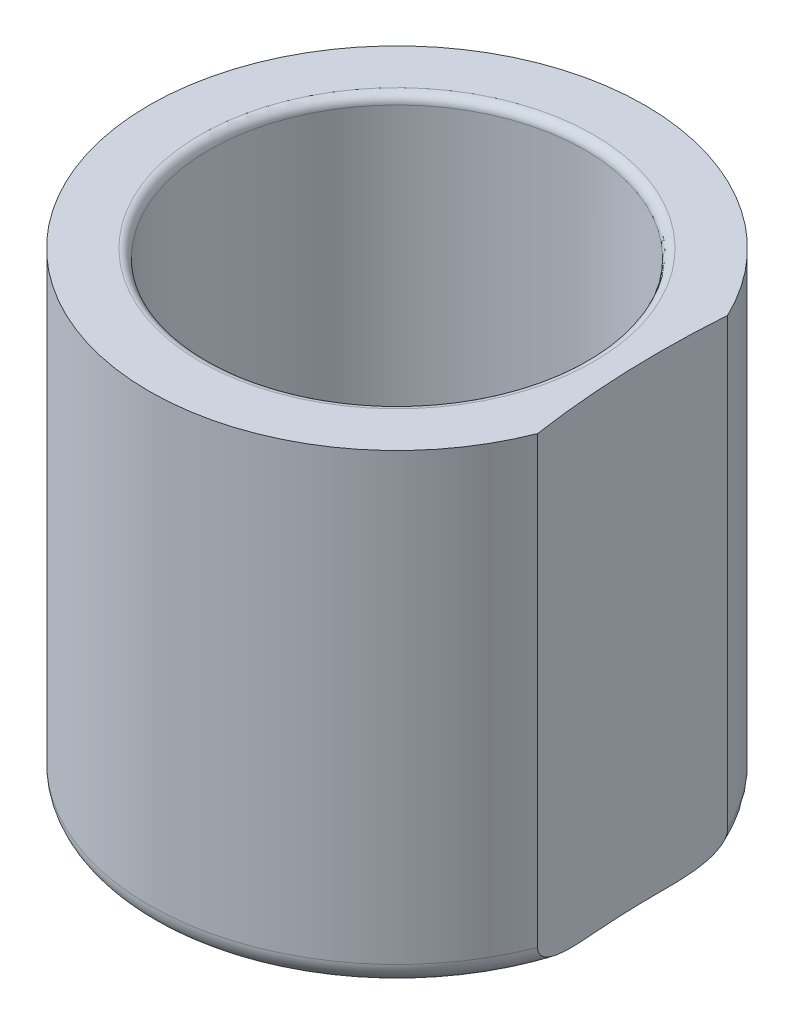
ISO-10303-21;
HEADER;
FILE_DESCRIPTION(('STEP AP214'),'2;1');
FILE_NAME('part.step','',(''),(''),'','','');
FILE_SCHEMA(('AUTOMOTIVE_DESIGN { 1 0 10303 214 1 1 1 1 }'));
ENDSEC;
DATA;
#1=APPLICATION_CONTEXT('core data for automotive mechanical design processes');
#2=APPLICATION_PROTOCOL_DEFINITION('international standard','automotive_design',2000,#1);
#3=PRODUCT_CONTEXT('',#1,'mechanical');
#4=PRODUCT('Part','Part','',(#3));
#5=PRODUCT_RELATED_PRODUCT_CATEGORY('part','',(#4));
#6=PRODUCT_DEFINITION_FORMATION('','',#4);
#7=PRODUCT_DEFINITION_CONTEXT('part definition',#1,'design');
#8=PRODUCT_DEFINITION('design','',#6,#7);
#9=PRODUCT_DEFINITION_SHAPE('','',#8);
#10=(LENGTH_UNIT() NAMED_UNIT(*) SI_UNIT(.MILLI.,.METRE.));
#11=(NAMED_UNIT(*) PLANE_ANGLE_UNIT() SI_UNIT($,.RADIAN.));
#12=(NAMED_UNIT(*) SI_UNIT($,.STERADIAN.) SOLID_ANGLE_UNIT());
#13=UNCERTAINTY_MEASURE_WITH_UNIT(LENGTH_MEASURE(1.E-05),#10,'distance_accuracy_value','');
#14=(GEOMETRIC_REPRESENTATION_CONTEXT(3) GLOBAL_UNCERTAINTY_ASSIGNED_CONTEXT((#13)) GLOBAL_UNIT_ASSIGNED_CONTEXT((#10,
#11,#12)) REPRESENTATION_CONTEXT('',''));
#15=CARTESIAN_POINT('',(0.,0.,0.));
#16=DIRECTION('',(0.,0.,1.));
#17=DIRECTION('',(1.,0.,0.));
#18=AXIS2_PLACEMENT_3D('',#15,#16,#17);
#19=CARTESIAN_POINT('',(0.,29.213224893918,0.));
#20=DIRECTION('',(0.,1.,0.));
#21=DIRECTION('',(0.,0.,1.));
#22=AXIS2_PLACEMENT_3D('',#19,#20,#21);
#23=CYLINDRICAL_SURFACE('',#22,14.115);
#24=CARTESIAN_POINT('',(3.,6.37,-13.7925061174538));
#25=CARTESIAN_POINT('',(2.99999412147623,6.53645643073001,-13.7925094750703));
#26=CARTESIAN_POINT('',(2.98609903156864,6.7029846418332,-13.7955522663016));
#27=CARTESIAN_POINT('',(2.93094168004821,7.03131373794816,-13.8073738317192));
#28=CARTESIAN_POINT('',(2.88965891695471,7.19311098672018,-13.8161569028105));
#29=CARTESIAN_POINT('',(2.78107782474294,7.50718104383363,-13.8384203829386));
#30=CARTESIAN_POINT('',(2.71380713104617,7.65946377069592,-13.8518958006637));
#31=CARTESIAN_POINT('',(2.55523771551061,7.95058264085685,-13.8820196533567));
#32=CARTESIAN_POINT('',(2.46393977403959,8.0894192206652,-13.8986679852684));
#33=CARTESIAN_POINT('',(2.25835464639057,8.35192390983083,-13.9335586012594));
#34=CARTESIAN_POINT('',(2.14375686122683,8.47534622867279,-13.9518203030798));
#35=CARTESIAN_POINT('',(1.89549576645274,8.70136857061071,-13.9877097254746));
#36=CARTESIAN_POINT('',(1.76183102682407,8.8039670305212,-14.0053373983726));
#37=CARTESIAN_POINT('',(1.47758916898466,8.98639527775488,-14.0381833888312));
#38=CARTESIAN_POINT('',(1.32685772733188,9.06598961453787,-14.0533761277533));
#39=CARTESIAN_POINT('',(1.01378257236626,9.1986282898201,-14.0794215113183));
#40=CARTESIAN_POINT('',(0.851440090387251,9.25167543885243,-14.090274615371));
#41=CARTESIAN_POINT('',(0.522305254101432,9.32894354439656,-14.1062806723936));
#42=CARTESIAN_POINT('',(0.3556145465021,9.35358018346907,-14.1115157434183));
#43=CARTESIAN_POINT('',(0.020389241384238,9.37462665604758,-14.1159800922837));
#44=CARTESIAN_POINT('',(-0.148145154511081,9.37103954584991,-14.1152100204098));
#45=CARTESIAN_POINT('',(-0.479411307116214,9.3360518702138,-14.1078139050109));
#46=CARTESIAN_POINT('',(-0.642192789939492,9.30509925492103,-14.1012821787811));
#47=CARTESIAN_POINT('',(-0.960197050862472,9.21697189635853,-14.0832037452649));
#48=CARTESIAN_POINT('',(-1.11541949967842,9.15979601188903,-14.0716568197253));
#49=CARTESIAN_POINT('',(-1.41515467072137,9.02044256117891,-14.044692441729));
#50=CARTESIAN_POINT('',(-1.55958507620938,8.93809326817811,-14.0292485354651));
#51=CARTESIAN_POINT('',(-1.83274131297418,8.75085830475106,-13.9961867275779));
#52=CARTESIAN_POINT('',(-1.96146511345106,8.6459697249177,-13.9785685454207));
#53=CARTESIAN_POINT('',(-2.20221644140704,8.4141884147887,-13.9426897097785));
#54=CARTESIAN_POINT('',(-2.31386596225532,8.28690362055968,-13.9244232350189));
#55=CARTESIAN_POINT('',(-2.51430214959669,8.0152295442304,-13.8896324329149));
#56=CARTESIAN_POINT('',(-2.6030882641507,7.87083984932837,-13.8731081476339));
#57=CARTESIAN_POINT('',(-2.75543240309796,7.56846680843353,-13.8436585552188));
#58=CARTESIAN_POINT('',(-2.81892248561421,7.41044822171274,-13.8307429679732));
#59=CARTESIAN_POINT('',(-2.91833575232633,7.08564628432321,-13.8101102745674));
#60=CARTESIAN_POINT('',(-2.95426304117057,6.91886424266147,-13.8023923943861));
#61=CARTESIAN_POINT('',(-2.99695184007049,6.58471423461579,-13.7931859003058));
#62=CARTESIAN_POINT('',(-3.00426221450883,6.41741953631562,-13.791580075742));
#63=CARTESIAN_POINT('',(-2.99099258971591,6.08400168665774,-13.7944638583056));
#64=CARTESIAN_POINT('',(-2.9704143916454,5.91787846033798,-13.79895307179));
#65=CARTESIAN_POINT('',(-2.9024269609853,5.59340770171829,-13.8134107362202));
#66=CARTESIAN_POINT('',(-2.85531695195922,5.43499449777903,-13.8233180468379));
#67=CARTESIAN_POINT('',(-2.73592578612435,5.12830969320165,-13.8474409719187));
#68=CARTESIAN_POINT('',(-2.66364233185416,4.98003901970257,-13.8616569796009));
#69=CARTESIAN_POINT('',(-2.49473565825036,4.69546391158521,-13.8930550034209));
#70=CARTESIAN_POINT('',(-2.39777251762799,4.55936576645693,-13.9102772894017));
#71=CARTESIAN_POINT('',(-2.18270649334491,4.30517141841314,-13.9456397127932));
#72=CARTESIAN_POINT('',(-2.06460113791625,4.18707732337046,-13.9637799573459));
#73=CARTESIAN_POINT('',(-1.8081262182196,3.97012973618621,-13.9993187037873));
#74=CARTESIAN_POINT('',(-1.66943800492996,3.87164940371005,-14.0166986530719));
#75=CARTESIAN_POINT('',(-1.3771674010835,3.69938595136477,-14.0484237501984));
#76=CARTESIAN_POINT('',(-1.22358568466595,3.62560171432435,-14.0627690353078));
#77=CARTESIAN_POINT('',(-0.906815859451438,3.50535287442693,-14.0867299038964));
#78=CARTESIAN_POINT('',(-0.743693554285119,3.45872094582156,-14.0963743946018));
#79=CARTESIAN_POINT('',(-0.411703516340845,3.39357512042099,-14.1099716576342));
#80=CARTESIAN_POINT('',(-0.242836573046695,3.37505737573536,-14.1139252088565));
#81=CARTESIAN_POINT('',(0.0922994747399018,3.36683046825706,-14.1156736057154));
#82=CARTESIAN_POINT('',(0.25855449610374,3.37656287258028,-14.1135878352638));
#83=CARTESIAN_POINT('',(0.587001722488407,3.42331636423377,-14.1037461047472));
#84=CARTESIAN_POINT('',(0.74919399272448,3.46033701324277,-14.0959902357588));
#85=CARTESIAN_POINT('',(1.06450814730505,3.56035492157597,-14.0756867576259));
#86=CARTESIAN_POINT('',(1.21765480948152,3.62327705988447,-14.0631530132659));
#87=CARTESIAN_POINT('',(1.51129322667209,3.77323694151756,-14.034635914485));
#88=CARTESIAN_POINT('',(1.6517838269392,3.86027688241836,-14.0186522457417));
#89=CARTESIAN_POINT('',(1.91885893903132,4.05784391574251,-13.9846228641881));
#90=CARTESIAN_POINT('',(2.04514716094388,4.1687660709939,-13.966545177141));
#91=CARTESIAN_POINT('',(2.27750874304568,4.41014681898469,-13.930543308083));
#92=CARTESIAN_POINT('',(2.38357725641945,4.54061008252426,-13.9126191638583));
#93=CARTESIAN_POINT('',(2.57375691493044,4.81932448080308,-13.8787057418542));
#94=CARTESIAN_POINT('',(2.65757782125555,4.9677771057341,-13.8627433729498));
#95=CARTESIAN_POINT('',(2.79894951677046,5.27696549675998,-13.8348956840708));
#96=CARTESIAN_POINT('',(2.85652308702954,5.43769046919346,-13.8230068307713));
#97=CARTESIAN_POINT('',(2.9331840059425,5.72720813426567,-13.8069103463557));
#98=CARTESIAN_POINT('',(2.95819306590036,5.85440157749816,-13.8015437913692));
#99=CARTESIAN_POINT('',(2.99160298828621,6.11104893168648,-13.7943404476489));
#100=CARTESIAN_POINT('',(3.000004573285,6.24050274404918,-13.7925035053461));
#101=CARTESIAN_POINT('',(3.,6.37,-13.7925061174538));
#102=B_SPLINE_CURVE_WITH_KNOTS('',3,(#24,#25,#26,#27,#28,#29,#30,#31,#32,#33,#34,#35,#36,#37,
#38,#39,#40,#41,#42,#43,#44,#45,#46,#47,#48,#49,#50,#51,#52,#53,#54,#55,#56,#57,#58,#59,#60,#61,
#62,#63,#64,#65,#66,#67,#68,#69,#70,#71,#72,#73,#74,#75,#76,#77,#78,#79,#80,#81,#82,#83,#84,#85,
#86,#87,#88,#89,#90,#91,#92,#93,#94,#95,#96,#97,#98,#99,#100,#101),.UNSPECIFIED.,.T.,.F.,(4,2,2,
2,2,2,2,2,2,2,2,2,2,2,2,2,2,2,2,2,2,2,2,2,2,2,2,2,2,2,2,2,2,2,2,2,2,2,4),(0.,0.498894850621412,
0.998163578985284,1.49690284271983,1.99562591017468,2.5014935015077,3.00739905279043,
3.51831276317341,4.02917237201329,4.532458618513,5.03569036584888,5.53083406966507,
6.02599932348336,6.52462084414041,7.02330676636265,7.53179694885821,8.04029940552211,
8.55015857311354,9.05994179778421,9.55989818183311,10.0598222781446,10.554218036175,
11.0486589271998,11.5503179581411,12.05203567714,12.5625395260742,13.0730202783471,
13.5803209635528,14.0875522100195,14.584825495748,15.0820907941285,15.5779239435024,
16.073802287278,16.578618503212,17.0835555756264,17.5947879137817,18.105575685056,
18.49371524188,18.8818379108579),.UNSPECIFIED.);
#103=CARTESIAN_POINT('',(3.,6.37,-13.7925061174538));
#104=VERTEX_POINT('',#103);
#105=EDGE_CURVE('E99',#104,#104,#102,.T.);
#106=ORIENTED_EDGE('',*,*,#105,.T.);
#107=EDGE_LOOP('',(#106));
#108=FACE_BOUND('',#107,.T.);
#109=DIRECTION('',(0.,-1.,0.));
#110=VECTOR('',#109,1.);
#111=CARTESIAN_POINT('',(12.7296033649603,210.3,-6.09839513075294));
#112=LINE('',#111,#110);
#113=CARTESIAN_POINT('',(12.7296033649603,1.3,-6.09839513075295));
#114=VERTEX_POINT('',#113);
#115=CARTESIAN_POINT('',(12.7296033649603,26.65,-6.09839513075294));
#116=VERTEX_POINT('',#115);
#117=EDGE_CURVE('E58',#114,#116,#112,.F.);
#118=ORIENTED_EDGE('',*,*,#117,.F.);
#119=CARTESIAN_POINT('',(0.,1.3,0.));
#120=DIRECTION('',(0.,1.,0.));
#121=DIRECTION('',(0.,0.,1.));
#122=AXIS2_PLACEMENT_3D('',#119,#120,#121);
#123=CIRCLE('',#122,14.115);
#124=CARTESIAN_POINT('',(13.146680042645,1.3,5.13790121122627));
#125=VERTEX_POINT('',#124);
#126=EDGE_CURVE('E84',#114,#125,#123,.T.);
#127=ORIENTED_EDGE('',*,*,#126,.T.);
#128=DIRECTION('',(0.,-1.,0.));
#129=VECTOR('',#128,1.);
#130=CARTESIAN_POINT('',(13.146680042645,210.3,5.13790121122624));
#131=LINE('',#130,#129);
#132=CARTESIAN_POINT('',(13.146680042645,26.6500000000001,5.13790121122624));
#133=VERTEX_POINT('',#132);
#134=EDGE_CURVE('E52',#133,#125,#131,.T.);
#135=ORIENTED_EDGE('',*,*,#134,.F.);
#136=CARTESIAN_POINT('',(0.,26.65,0.));
#137=DIRECTION('',(0.,1.,0.));
#138=DIRECTION('',(0.,0.,1.));
#139=AXIS2_PLACEMENT_3D('',#136,#137,#138);
#140=CIRCLE('',#139,14.115);
#141=EDGE_CURVE('E89',#116,#133,#140,.T.);
#142=ORIENTED_EDGE('',*,*,#141,.F.);
#143=EDGE_LOOP('',(#118,#127,#135,#142));
#144=FACE_BOUND('',#143,.T.);
#145=ADVANCED_FACE('F32',(#108,#144),#23,.T.);
#146=CARTESIAN_POINT('',(0.,1.3,0.));
#147=DIRECTION('',(0.,1.,0.));
#148=DIRECTION('',(0.,0.,1.));
#149=AXIS2_PLACEMENT_3D('',#146,#147,#148);
#150=TOROIDAL_SURFACE('',#149,12.815,1.3);
#151=ORIENTED_EDGE('',*,*,#126,.F.);
#152=CARTESIAN_POINT('',(12.7296033626797,1.3002,-6.09839509990498));
#153=CARTESIAN_POINT('',(12.7296041824527,1.28081584003518,-6.09840517398511));
#154=CARTESIAN_POINT('',(12.7295399175589,1.26144219360172,-6.09753699841514));
#155=CARTESIAN_POINT('',(12.7292851142724,1.22286383647914,-6.09408846345464));
#156=CARTESIAN_POINT('',(12.7290946765854,1.20365900342742,-6.09150946956271));
#157=CARTESIAN_POINT('',(12.7283444418494,1.14682587599791,-6.08133372325771));
#158=CARTESIAN_POINT('',(12.7276055751514,1.10961532737515,-6.07129649358075));
#159=CARTESIAN_POINT('',(12.7257215819372,1.03741050051104,-6.04553512561307));
#160=CARTESIAN_POINT('',(12.7245776310452,1.00241015064777,-6.02982744141806));
#161=CARTESIAN_POINT('',(12.7219684168696,0.93488753522417,-5.99369446249934));
#162=CARTESIAN_POINT('',(12.7205024204057,0.902371156190564,-5.97325839723018));
#163=CARTESIAN_POINT('',(12.7162730308058,0.819149160149172,-5.91368946479091));
#164=CARTESIAN_POINT('',(12.7132985993208,0.770858363431658,-5.8712052041753));
#165=CARTESIAN_POINT('',(12.7070042224387,0.681397810314968,-5.77933634707736));
#166=CARTESIAN_POINT('',(12.7036833419474,0.640248168660728,-5.72993294556411));
#167=CARTESIAN_POINT('',(12.697338919585,0.569097062942313,-5.63321927478415));
#168=CARTESIAN_POINT('',(12.6943317710201,0.538342780019552,-5.58645133734662));
#169=CARTESIAN_POINT('',(12.6882985219637,0.480961013044156,-5.49042566540667));
#170=CARTESIAN_POINT('',(12.6852724081675,0.454336870127774,-5.44116595742529));
#171=CARTESIAN_POINT('',(12.6792594801589,0.40464960838571,-5.34080168374603));
#172=CARTESIAN_POINT('',(12.6762727355153,0.381592176561382,-5.28969432887046));
#173=CARTESIAN_POINT('',(12.6703858506568,0.338621605862661,-5.18620198933674));
#174=CARTESIAN_POINT('',(12.6674856831812,0.318707468607428,-5.13381741647939));
#175=CARTESIAN_POINT('',(12.6607157258409,0.274531792400903,-5.00792687617786));
#176=CARTESIAN_POINT('',(12.6568979514722,0.251508580644194,-4.93398468110464));
#177=CARTESIAN_POINT('',(12.6495311594926,0.209798688372761,-4.78486242261106));
#178=CARTESIAN_POINT('',(12.645982269214,0.191114053886195,-4.70968179298314));
#179=CARTESIAN_POINT('',(12.6357794410156,0.140447829145473,-4.48267768874946));
#180=CARTESIAN_POINT('',(12.6295815060557,0.11392720756143,-4.32961660570749));
#181=CARTESIAN_POINT('',(12.6185110025514,0.071115258168662,-4.02133210936989));
#182=CARTESIAN_POINT('',(12.6136455295908,0.054878112553256,-3.86610157602079));
#183=CARTESIAN_POINT('',(12.6053335047275,0.0298282270868725,-3.55517691361164));
#184=CARTESIAN_POINT('',(12.6018856694507,0.0210087644802369,-3.39948333295253));
#185=CARTESIAN_POINT('',(12.5951243980496,0.00541717175483643,-3.01391638993998));
#186=CARTESIAN_POINT('',(12.5926521152591,0.00160556869540966,-2.78392293590034));
#187=CARTESIAN_POINT('',(12.5908318632627,-0.000761414239344936,-2.32384838585681));
#188=CARTESIAN_POINT('',(12.5914852219093,0.000685439749940661,-2.09376729413292));
#189=CARTESIAN_POINT('',(12.5959097807801,0.004759532449018,-1.63443071755934));
#190=CARTESIAN_POINT('',(12.5996703544888,0.00738273414858559,-1.40517508972293));
#191=CARTESIAN_POINT('',(12.6102945446138,0.0112316065797833,-0.946774230955752));
#192=CARTESIAN_POINT('',(12.6171574435868,0.0124576001988314,-0.717628986755975));
#193=CARTESIAN_POINT('',(12.6342057460806,0.0125822428836527,-0.253437475770988));
#194=CARTESIAN_POINT('',(12.644473631457,0.0114189583429891,-0.018394192353608));
#195=CARTESIAN_POINT('',(12.6682751628644,0.00755616510299804,0.451559967353724));
#196=CARTESIAN_POINT('',(12.6818095314819,0.0048563163169307,0.68647080280374));
#197=CARTESIAN_POINT('',(12.7121361385314,0.000661637229549095,1.15600177551904));
#198=CARTESIAN_POINT('',(12.7289269379394,-0.000833723838956833,1.39062199528814));
#199=CARTESIAN_POINT('',(12.7565524106687,0.0011445741662687,1.74231291782035));
#200=CARTESIAN_POINT('',(12.7661658929434,0.00250706527981908,1.85948652921465));
#201=CARTESIAN_POINT('',(12.7862021897459,0.00736531096477314,2.0937201082407));
#202=CARTESIAN_POINT('',(12.7966249800539,0.0108610017184358,2.21078007916725));
#203=CARTESIAN_POINT('',(12.8220985156898,0.0225585061053475,2.48606667114151));
#204=CARTESIAN_POINT('',(12.8374826327687,0.0319872311425532,2.64421527331146));
#205=CARTESIAN_POINT('',(12.869705636522,0.0587783712680957,2.96011244579853));
#206=CARTESIAN_POINT('',(12.8865476352369,0.0761581152270149,3.11785938164485));
#207=CARTESIAN_POINT('',(12.9142239066577,0.112627281997397,3.36615179583768));
#208=CARTESIAN_POINT('',(12.9246345405326,0.127981174396329,3.45728804549613));
#209=CARTESIAN_POINT('',(12.9458374635132,0.163414398229507,3.63858224242181));
#210=CARTESIAN_POINT('',(12.9566296262021,0.183492176681587,3.72874050103631));
#211=CARTESIAN_POINT('',(12.978475490358,0.229375129495982,3.90724059979417));
#212=CARTESIAN_POINT('',(12.9895281510719,0.255160131099964,3.99558766887079));
#213=CARTESIAN_POINT('',(13.0117819642812,0.313852304329358,4.16982771777642));
#214=CARTESIAN_POINT('',(13.0229829407141,0.346751637463247,4.25572328167338));
#215=CARTESIAN_POINT('',(13.0422228021861,0.411211512127845,4.40049051119226));
#216=CARTESIAN_POINT('',(13.0502839546036,0.440650902319532,4.46029631947626));
#217=CARTESIAN_POINT('',(13.0662130265822,0.505167578536124,4.57697236468482));
#218=CARTESIAN_POINT('',(13.0740806905005,0.540251905196988,4.63383881692449));
#219=CARTESIAN_POINT('',(13.089436655567,0.617416642522118,4.74355353224906));
#220=CARTESIAN_POINT('',(13.0969207412822,0.659559165382358,4.79635944131996));
#221=CARTESIAN_POINT('',(13.1110131531371,0.751710774614094,4.89480259127156));
#222=CARTESIAN_POINT('',(13.1176235405866,0.801700713557755,4.94045675416249));
#223=CARTESIAN_POINT('',(13.1271212407918,0.889692419946821,5.00556100304252));
#224=CARTESIAN_POINT('',(13.130473242632,0.925121317732085,5.02840527042231));
#225=CARTESIAN_POINT('',(13.136374999609,0.999011651739431,5.06847922046647));
#226=CARTESIAN_POINT('',(13.1389272050488,1.03746336513405,5.08572605765217));
#227=CARTESIAN_POINT('',(13.1428102194072,1.11276292379161,5.11190982719582));
#228=CARTESIAN_POINT('',(13.1442397463327,1.14936811938805,5.12151964317786));
#229=CARTESIAN_POINT('',(13.1461865126949,1.2240105243062,5.13459112202012));
#230=CARTESIAN_POINT('',(13.1466954079936,1.26205767135394,5.13799655343412));
#231=CARTESIAN_POINT('',(13.1466800380838,1.30019999999999,5.13790118063225));
#232=B_SPLINE_CURVE_WITH_KNOTS('',3,(#152,#153,#154,#155,#156,#157,#158,#159,#160,#161,#162,
#163,#164,#165,#166,#167,#168,#169,#170,#171,#172,#173,#174,#175,#176,#177,#178,#179,#180,#181,
#182,#183,#184,#185,#186,#187,#188,#189,#190,#191,#192,#193,#194,#195,#196,#197,#198,#199,#200,
#201,#202,#203,#204,#205,#206,#207,#208,#209,#210,#211,#212,#213,#214,#215,#216,#217,#218,#219,
#220,#221,#222,#223,#224,#225,#226,#227,#228,#229,#230,#231),.UNSPECIFIED.,.F.,.F.,(4,2,2,2,2,2,
2,2,2,2,2,2,2,2,2,2,2,2,2,2,2,2,2,2,2,2,2,2,2,2,2,2,2,2,2,2,2,2,2,4),(0.,0.0581124264229541,
0.116178525826784,0.231235134019455,0.345960528468913,0.46094986874713,0.653004744946748,
0.845592105275012,1.01351319049927,1.18156941736158,1.34989090191148,1.51815881573221,
1.75059785920737,1.98314629690895,2.44894951807445,2.9171870090218,3.38499967071391,
4.07494045280613,4.76517436544967,5.45305743698498,6.14078151011554,6.84655719737039,
7.55248915426953,8.25810986613696,8.61081902301212,8.96351762860188,9.44091513456192,
9.91935809935202,10.1982771197858,10.4771045731269,10.754961789116,11.0325144108997,
11.2337184158037,11.4351753455899,11.6385084627693,11.8413529521346,11.967824673447,
12.0939050524187,12.2070008717753,12.3211166945996),.UNSPECIFIED.);
#233=CARTESIAN_POINT('',(12.5913540828842,0.,-2.38370035017753));
#234=VERTEX_POINT('',#233);
#235=EDGE_CURVE('E11',#114,#234,#232,.T.);
#236=ORIENTED_EDGE('',*,*,#235,.T.);
#237=CARTESIAN_POINT('',(0.,0.,0.));
#238=DIRECTION('',(0.,1.,0.));
#239=DIRECTION('',(0.,0.,1.));
#240=AXIS2_PLACEMENT_3D('',#237,#238,#239);
#241=CIRCLE('',#240,12.815);
#242=CARTESIAN_POINT('',(12.733421368005,0.,1.44367768730898));
#243=VERTEX_POINT('',#242);
#244=EDGE_CURVE('E79',#243,#234,#241,.F.);
#245=ORIENTED_EDGE('',*,*,#244,.F.);
#246=EDGE_CURVE('E36',#243,#125,#232,.T.);
#247=ORIENTED_EDGE('',*,*,#246,.T.);
#248=EDGE_LOOP('',(#151,#236,#245,#247));
#249=FACE_BOUND('',#248,.T.);
#250=ADVANCED_FACE('F82',(#249),#150,.T.);
#251=CARTESIAN_POINT('',(0.,0.,0.));
#252=DIRECTION('',(0.,1.,0.));
#253=DIRECTION('',(0.,0.,1.));
#254=AXIS2_PLACEMENT_3D('',#251,#252,#253);
#255=PLANE('',#254);
#256=CARTESIAN_POINT('',(63.3913448086797,0.,-2.35300411114919));
#257=DIRECTION('',(0.,1.,0.));
#258=DIRECTION('',(0.,0.,1.));
#259=AXIS2_PLACEMENT_3D('',#256,#257,#258);
#260=CIRCLE('',#259,50.8);
#261=EDGE_CURVE('E70',#243,#234,#260,.F.);
#262=ORIENTED_EDGE('',*,*,#261,.F.);
#263=ORIENTED_EDGE('',*,*,#244,.T.);
#264=EDGE_LOOP('',(#262,#263));
#265=FACE_BOUND('',#264,.T.);
#266=ADVANCED_FACE('F78',(#265),#255,.F.);
#267=CARTESIAN_POINT('',(0.,26.65,-14.115));
#268=DIRECTION('',(0.,-1.,0.));
#269=DIRECTION('',(0.,0.,-1.));
#270=AXIS2_PLACEMENT_3D('',#267,#268,#269);
#271=PLANE('',#270);
#272=CARTESIAN_POINT('',(63.3913448086797,26.65,-2.35300411114919));
#273=DIRECTION('',(0.,-1.,0.));
#274=DIRECTION('',(0.,0.,-1.));
#275=AXIS2_PLACEMENT_3D('',#272,#273,#274);
#276=CIRCLE('',#275,50.8);
#277=EDGE_CURVE('E80',#116,#133,#276,.F.);
#278=ORIENTED_EDGE('',*,*,#277,.F.);
#279=ORIENTED_EDGE('',*,*,#141,.T.);
#280=EDGE_LOOP('',(#278,#279));
#281=FACE_BOUND('',#280,.T.);
#282=CARTESIAN_POINT('',(0.,26.65,0.));
#283=DIRECTION('',(0.,-1.,0.));
#284=DIRECTION('',(0.,0.,-1.));
#285=AXIS2_PLACEMENT_3D('',#282,#283,#284);
#286=CIRCLE('',#285,11.2);
#287=CARTESIAN_POINT('',(0.,26.65,-11.2));
#288=VERTEX_POINT('',#287);
#289=EDGE_CURVE('E75',#288,#288,#286,.T.);
#290=ORIENTED_EDGE('',*,*,#289,.T.);
#291=EDGE_LOOP('',(#290));
#292=FACE_BOUND('',#291,.T.);
#293=ADVANCED_FACE('F124',(#281,#292),#271,.F.);
#294=CARTESIAN_POINT('',(0.,29.213224893918,0.));
#295=DIRECTION('',(0.,1.,0.));
#296=DIRECTION('',(0.,0.,1.));
#297=AXIS2_PLACEMENT_3D('',#294,#295,#296);
#298=CYLINDRICAL_SURFACE('',#297,10.7);
#299=CARTESIAN_POINT('',(0.,26.15,0.));
#300=DIRECTION('',(0.,-1.,0.));
#301=DIRECTION('',(0.,0.,-1.));
#302=AXIS2_PLACEMENT_3D('',#299,#300,#301);
#303=CIRCLE('',#302,10.7);
#304=CARTESIAN_POINT('',(0.,26.15,-10.7));
#305=VERTEX_POINT('',#304);
#306=EDGE_CURVE('E152',#305,#305,#303,.F.);
#307=ORIENTED_EDGE('',*,*,#306,.T.);
#308=EDGE_LOOP('',(#307));
#309=FACE_BOUND('',#308,.T.);
#310=CARTESIAN_POINT('',(0.,3.29,0.));
#311=DIRECTION('',(0.,-1.,0.));
#312=DIRECTION('',(0.,0.,-1.));
#313=AXIS2_PLACEMENT_3D('',#310,#311,#312);
#314=CIRCLE('',#313,10.7);
#315=CARTESIAN_POINT('',(0.,3.29,-10.7));
#316=VERTEX_POINT('',#315);
#317=EDGE_CURVE('E87',#316,#316,#314,.T.);
#318=ORIENTED_EDGE('',*,*,#317,.T.);
#319=EDGE_LOOP('',(#318));
#320=FACE_BOUND('',#319,.T.);
#321=CARTESIAN_POINT('',(3.,6.37,-10.2708324881676));
#322=CARTESIAN_POINT('',(2.9999967228815,6.20508270253244,-10.2708349775262));
#323=CARTESIAN_POINT('',(2.98635483084718,6.0401318835673,-10.2748480166403));
#324=CARTESIAN_POINT('',(2.93226571260781,5.71501742629221,-10.2904122744618));
#325=CARTESIAN_POINT('',(2.8918068624837,5.5548558953952,-10.3019667620072));
#326=CARTESIAN_POINT('',(2.78553723574348,5.24407119515004,-10.3312046876485));
#327=CARTESIAN_POINT('',(2.71976467364351,5.09343404463387,-10.3488788831906));
#328=CARTESIAN_POINT('',(2.5648568959971,4.80530305512079,-10.3883527272422));
#329=CARTESIAN_POINT('',(2.47571917669203,4.66781062683944,-10.4101528178039));
#330=CARTESIAN_POINT('',(2.2739751771782,4.40607152364888,-10.4560976533736));
#331=CARTESIAN_POINT('',(2.16083782559473,4.28224199776175,-10.4802873942017));
#332=CARTESIAN_POINT('',(1.91544668464256,4.05504240927753,-10.527899214581));
#333=CARTESIAN_POINT('',(1.78319073556003,3.95167466125519,-10.551321207037));
#334=CARTESIAN_POINT('',(1.50039421303493,3.7665648432042,-10.5952642175993));
#335=CARTESIAN_POINT('',(1.34956940332565,3.68524171831235,-10.6157259917953));
#336=CARTESIAN_POINT('',(1.03571645595167,3.54926907771822,-10.6509242237713));
#337=CARTESIAN_POINT('',(0.872690608945508,3.49461456958841,-10.6656617530379));
#338=CARTESIAN_POINT('',(0.543421646247377,3.41489276127369,-10.6874327342015));
#339=CARTESIAN_POINT('',(0.377363006445446,3.38911486984736,-10.6946508924604));
#340=CARTESIAN_POINT('',(0.0431316316035489,3.36563791191318,-10.7012174999914));
#341=CARTESIAN_POINT('',(-0.125040708044959,3.36793366976277,-10.7005673998514));
#342=CARTESIAN_POINT('',(-0.453764199551386,3.40004774124804,-10.6916041822539));
#343=CARTESIAN_POINT('',(-0.614397155294636,3.42909764531278,-10.6835050190762));
#344=CARTESIAN_POINT('',(-0.928409526899082,3.51264851908248,-10.6608091546383));
#345=CARTESIAN_POINT('',(-1.08178850816863,3.56715101155139,-10.6462120646262));
#346=CARTESIAN_POINT('',(-1.37884663407701,3.70062112502917,-10.6118517624846));
#347=CARTESIAN_POINT('',(-1.52240496024041,3.77984333094895,-10.5920351423958));
#348=CARTESIAN_POINT('',(-1.79444557169072,3.96030641589112,-10.5493579660175));
#349=CARTESIAN_POINT('',(-1.92292464684417,4.06155197029288,-10.5264967637879));
#350=CARTESIAN_POINT('',(-2.16574724320712,4.28723039928137,-10.4792829279641));
#351=CARTESIAN_POINT('',(-2.27946534739197,4.41233195083515,-10.4549060035976));
#352=CARTESIAN_POINT('',(-2.48447035691634,4.68007752864435,-10.408097534102));
#353=CARTESIAN_POINT('',(-2.57575557927335,4.82272286988397,-10.3856661350138));
#354=CARTESIAN_POINT('',(-2.73384798777943,5.12297732580998,-10.3451831188416));
#355=CARTESIAN_POINT('',(-2.8004680475124,5.28068985359617,-10.3271653211241));
#356=CARTESIAN_POINT('',(-2.90603452263783,5.60571136918759,-10.2979608214584));
#357=CARTESIAN_POINT('',(-2.94498864399569,5.77301767073657,-10.2867722174546));
#358=CARTESIAN_POINT('',(-2.99300351555702,6.10658675422946,-10.2729031082969));
#359=CARTESIAN_POINT('',(-3.00300431102436,6.27270324111802,-10.2699551620004));
#360=CARTESIAN_POINT('',(-2.99543273208928,6.60423850341146,-10.2721662727349));
#361=CARTESIAN_POINT('',(-2.97786364953456,6.76965735974898,-10.2773243619042));
#362=CARTESIAN_POINT('',(-2.91648332136166,7.09136284344539,-10.2949063247531));
#363=CARTESIAN_POINT('',(-2.87325297265994,7.24776997297439,-10.3071692231369));
#364=CARTESIAN_POINT('',(-2.76243845184184,7.5511088895359,-10.3374180140772));
#365=CARTESIAN_POINT('',(-2.69485085862321,7.69803934210007,-10.3554047105295));
#366=CARTESIAN_POINT('',(-2.53538241277732,7.98214345902267,-10.3956112285357));
#367=CARTESIAN_POINT('',(-2.44295822895235,8.11899894841041,-10.4179221604226));
#368=CARTESIAN_POINT('',(-2.23710225540563,8.37560274379857,-10.4640565259288));
#369=CARTESIAN_POINT('',(-2.12366608568355,8.49534747378297,-10.4878802742166));
#370=CARTESIAN_POINT('',(-1.87462929520014,8.7183156592091,-10.5352890474087));
#371=CARTESIAN_POINT('',(-1.73843024347726,8.820879132079,-10.5588414025741));
#372=CARTESIAN_POINT('',(-1.45020995733941,9.00169636372215,-10.6022685323485));
#373=CARTESIAN_POINT('',(-1.29818955896,9.0799514061377,-10.6221435011249));
#374=CARTESIAN_POINT('',(-0.983703674963885,9.20918952907826,-10.6558490066268));
#375=CARTESIAN_POINT('',(-0.821328087129694,9.26037889579915,-10.6697251122222));
#376=CARTESIAN_POINT('',(-0.489827466160399,9.33460796354554,-10.6900705594729));
#377=CARTESIAN_POINT('',(-0.320704110327205,9.35765461557898,-10.6965417300586));
#378=CARTESIAN_POINT('',(0.0133531656284969,9.3744708773538,-10.7012517852729));
#379=CARTESIAN_POINT('',(0.178235416907091,9.36920394547489,-10.6997615911682));
#380=CARTESIAN_POINT('',(0.504671183418174,9.33180591657448,-10.6893393384179));
#381=CARTESIAN_POINT('',(0.666224847544711,9.29967602386934,-10.6804076133902));
#382=CARTESIAN_POINT('',(0.980129838686912,9.21003089728783,-10.6561693740834));
#383=CARTESIAN_POINT('',(1.13254658105699,9.15272923301239,-10.6409165514236));
#384=CARTESIAN_POINT('',(1.42568783388587,9.01455707612942,-10.6056228536375));
#385=CARTESIAN_POINT('',(1.56641057547327,8.93368302619794,-10.5855812559165));
#386=CARTESIAN_POINT('',(1.83657953327422,8.74794424739577,-10.5421179692709));
#387=CARTESIAN_POINT('',(1.96558271282783,8.64245412088997,-10.5186153790738));
#388=CARTESIAN_POINT('',(2.20438069339633,8.41163966520397,-10.4711775024219));
#389=CARTESIAN_POINT('',(2.31417024785405,8.28630993627252,-10.4472420997439));
#390=CARTESIAN_POINT('',(2.51416079761855,8.01560477600016,-10.4009527136819));
#391=CARTESIAN_POINT('',(2.60380300757427,7.86980628439222,-10.3786532755839));
#392=CARTESIAN_POINT('',(2.75718299839684,7.56460071544872,-10.3389679438791));
#393=CARTESIAN_POINT('',(2.82093599432635,7.40520169798281,-10.3215791661183));
#394=CARTESIAN_POINT('',(2.91340048992338,7.10057493030852,-10.2958270980413));
#395=CARTESIAN_POINT('',(2.94579401267367,6.95653370898252,-10.2865348323713));
#396=CARTESIAN_POINT('',(2.98909368444959,6.66500359845439,-10.2740368528427));
#397=CARTESIAN_POINT('',(3.00000293131666,6.51751520940693,-10.2708302614864));
#398=CARTESIAN_POINT('',(3.,6.37,-10.2708324881676));
#399=B_SPLINE_CURVE_WITH_KNOTS('',3,(#321,#322,#323,#324,#325,#326,#327,#328,#329,#330,#331,
#332,#333,#334,#335,#336,#337,#338,#339,#340,#341,#342,#343,#344,#345,#346,#347,#348,#349,#350,
#351,#352,#353,#354,#355,#356,#357,#358,#359,#360,#361,#362,#363,#364,#365,#366,#367,#368,#369,
#370,#371,#372,#373,#374,#375,#376,#377,#378,#379,#380,#381,#382,#383,#384,#385,#386,#387,#388,
#389,#390,#391,#392,#393,#394,#395,#396,#397,#398),.UNSPECIFIED.,.T.,.F.,(4,2,2,2,2,2,2,2,2,2,2,
2,2,2,2,2,2,2,2,2,2,2,2,2,2,2,2,2,2,2,2,2,2,2,2,2,2,2,4),(0.,0.494208793361037,
0.988631943735041,1.48231160396656,1.97604418746173,2.4821218626128,2.98825675107657,
3.50342597724713,4.01849872549668,4.52059737221551,5.02260345369938,5.51062638275111,
5.99867851272079,6.49193286086695,6.985292025309,7.49534522417528,8.00543667709834,
8.51932235872678,9.03306484839427,9.52992931303846,10.0267344565027,10.5127006350072,
10.9987350966199,11.496416455897,11.9942016750691,12.5080944258401,13.0219600351362,
13.5318505077271,14.0416150162766,14.5341453692427,15.0266536423435,15.5150615968482,
16.0035432955085,16.5061323502919,17.0088584308431,17.5241617417511,18.0391617696534,
18.48128536165,18.9233451986889),.UNSPECIFIED.);
#400=CARTESIAN_POINT('',(3.,6.37,-10.2708324881676));
#401=VERTEX_POINT('',#400);
#402=EDGE_CURVE('E93',#401,#401,#399,.T.);
#403=ORIENTED_EDGE('',*,*,#402,.T.);
#404=EDGE_LOOP('',(#403));
#405=FACE_BOUND('',#404,.T.);
#406=ADVANCED_FACE('F101',(#309,#320,#405),#298,.F.);
#407=CARTESIAN_POINT('',(0.,2.79,-10.7));
#408=DIRECTION('',(0.,-1.,0.));
#409=DIRECTION('',(0.,0.,-1.));
#410=AXIS2_PLACEMENT_3D('',#407,#408,#409);
#411=PLANE('',#410);
#412=CARTESIAN_POINT('',(0.,2.79,0.));
#413=DIRECTION('',(0.,-1.,0.));
#414=DIRECTION('',(0.,0.,-1.));
#415=AXIS2_PLACEMENT_3D('',#412,#413,#414);
#416=CIRCLE('',#415,10.2);
#417=CARTESIAN_POINT('',(0.,2.79,-10.2));
#418=VERTEX_POINT('',#417);
#419=EDGE_CURVE('E83',#418,#418,#416,.F.);
#420=ORIENTED_EDGE('',*,*,#419,.T.);
#421=EDGE_LOOP('',(#420));
#422=FACE_BOUND('',#421,.T.);
#423=ADVANCED_FACE('F109',(#422),#411,.F.);
#424=CARTESIAN_POINT('',(0.,6.37,-20.));
#425=DIRECTION('',(0.,0.,1.));
#426=DIRECTION('',(1.,0.,0.));
#427=AXIS2_PLACEMENT_3D('',#424,#425,#426);
#428=CYLINDRICAL_SURFACE('',#427,3.);
#429=ORIENTED_EDGE('',*,*,#402,.F.);
#430=EDGE_LOOP('',(#429));
#431=FACE_BOUND('',#430,.T.);
#432=ORIENTED_EDGE('',*,*,#105,.F.);
#433=EDGE_LOOP('',(#432));
#434=FACE_BOUND('',#433,.T.);
#435=ADVANCED_FACE('F105',(#431,#434),#428,.F.);
#436=CARTESIAN_POINT('',(0.,3.29,0.));
#437=DIRECTION('',(0.,-1.,0.));
#438=DIRECTION('',(0.,0.,-1.));
#439=AXIS2_PLACEMENT_3D('',#436,#437,#438);
#440=TOROIDAL_SURFACE('',#439,10.2,0.5);
#441=ORIENTED_EDGE('',*,*,#317,.F.);
#442=EDGE_LOOP('',(#441));
#443=FACE_BOUND('',#442,.T.);
#444=ORIENTED_EDGE('',*,*,#419,.F.);
#445=EDGE_LOOP('',(#444));
#446=FACE_BOUND('',#445,.T.);
#447=ADVANCED_FACE('F108',(#443,#446),#440,.F.);
#448=CARTESIAN_POINT('',(0.,26.15,0.));
#449=DIRECTION('',(0.,-1.,0.));
#450=DIRECTION('',(0.,0.,-1.));
#451=AXIS2_PLACEMENT_3D('',#448,#449,#450);
#452=TOROIDAL_SURFACE('',#451,11.2,0.5);
#453=ORIENTED_EDGE('',*,*,#289,.F.);
#454=EDGE_LOOP('',(#453));
#455=FACE_BOUND('',#454,.T.);
#456=ORIENTED_EDGE('',*,*,#306,.F.);
#457=EDGE_LOOP('',(#456));
#458=FACE_BOUND('',#457,.T.);
#459=ADVANCED_FACE('F34',(#455,#458),#452,.T.);
#460=CARTESIAN_POINT('',(63.3913448086797,433.3,-2.35300411114919));
#461=DIRECTION('',(0.,-1.,0.));
#462=DIRECTION('',(0.511093782083953,0.,-0.859524953631436));
#463=AXIS2_PLACEMENT_3D('',#460,#461,#462);
#464=CYLINDRICAL_SURFACE('',#463,50.8);
#465=ORIENTED_EDGE('',*,*,#117,.T.);
#466=ORIENTED_EDGE('',*,*,#277,.T.);
#467=ORIENTED_EDGE('',*,*,#134,.T.);
#468=ORIENTED_EDGE('',*,*,#246,.F.);
#469=ORIENTED_EDGE('',*,*,#261,.T.);
#470=ORIENTED_EDGE('',*,*,#235,.F.);
#471=EDGE_LOOP('',(#465,#466,#467,#468,#469,#470));
#472=FACE_BOUND('',#471,.T.);
#473=ADVANCED_FACE('F69',(#472),#464,.F.);
#474=CLOSED_SHELL('',(#145,#250,#266,#293,#406,#423,#435,#447,#459,#473));
#475=MANIFOLD_SOLID_BREP('B2',#474);
#476=ADVANCED_BREP_SHAPE_REPRESENTATION('',(#18,#475),#14);
#477=SHAPE_DEFINITION_REPRESENTATION(#9,#476);
ENDSEC;
END-ISO-10303-21;
